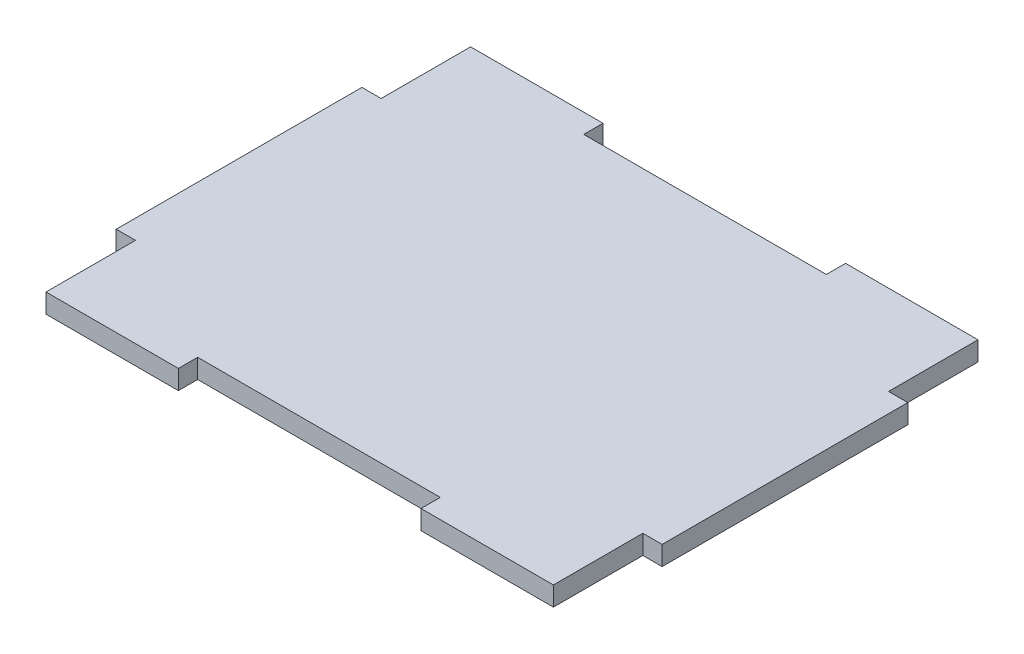
ISO-10303-21;
HEADER;
FILE_DESCRIPTION(('STEP AP214'),'2;1');
FILE_NAME('part.step','',(''),(''),'','','');
FILE_SCHEMA(('AUTOMOTIVE_DESIGN { 1 0 10303 214 1 1 1 1 }'));
ENDSEC;
DATA;
#1=APPLICATION_CONTEXT('core data for automotive mechanical design processes');
#2=APPLICATION_PROTOCOL_DEFINITION('international standard','automotive_design',2000,#1);
#3=PRODUCT_CONTEXT('',#1,'mechanical');
#4=PRODUCT('Part','Part','',(#3));
#5=PRODUCT_RELATED_PRODUCT_CATEGORY('part','',(#4));
#6=PRODUCT_DEFINITION_FORMATION('','',#4);
#7=PRODUCT_DEFINITION_CONTEXT('part definition',#1,'design');
#8=PRODUCT_DEFINITION('design','',#6,#7);
#9=PRODUCT_DEFINITION_SHAPE('','',#8);
#10=(LENGTH_UNIT() NAMED_UNIT(*) SI_UNIT(.MILLI.,.METRE.));
#11=(NAMED_UNIT(*) PLANE_ANGLE_UNIT() SI_UNIT($,.RADIAN.));
#12=(NAMED_UNIT(*) SI_UNIT($,.STERADIAN.) SOLID_ANGLE_UNIT());
#13=UNCERTAINTY_MEASURE_WITH_UNIT(LENGTH_MEASURE(1.E-05),#10,'distance_accuracy_value','');
#14=(GEOMETRIC_REPRESENTATION_CONTEXT(3) GLOBAL_UNCERTAINTY_ASSIGNED_CONTEXT((#13)) GLOBAL_UNIT_ASSIGNED_CONTEXT((#10,
#11,#12)) REPRESENTATION_CONTEXT('',''));
#15=CARTESIAN_POINT('',(0.,0.,0.));
#16=DIRECTION('',(0.,0.,1.));
#17=DIRECTION('',(1.,0.,0.));
#18=AXIS2_PLACEMENT_3D('',#15,#16,#17);
#19=CARTESIAN_POINT('',(-41.825,3.175,0.));
#20=DIRECTION('',(-1.,0.,0.));
#21=DIRECTION('',(0.,0.,1.));
#22=AXIS2_PLACEMENT_3D('',#19,#20,#21);
#23=PLANE('',#22);
#24=DIRECTION('',(0.,0.,-1.));
#25=VECTOR('',#24,1.);
#26=CARTESIAN_POINT('',(-41.825,0.,0.));
#27=LINE('',#26,#25);
#28=CARTESIAN_POINT('',(-41.825,0.,35.));
#29=VERTEX_POINT('',#28);
#30=CARTESIAN_POINT('',(-41.825,0.,20.25));
#31=VERTEX_POINT('',#30);
#32=EDGE_CURVE('E198',#29,#31,#27,.T.);
#33=ORIENTED_EDGE('',*,*,#32,.F.);
#34=DIRECTION('',(0.,-1.,0.));
#35=VECTOR('',#34,1.);
#36=CARTESIAN_POINT('',(-41.825,3.175,35.));
#37=LINE('',#36,#35);
#38=CARTESIAN_POINT('',(-41.825,3.175,35.));
#39=VERTEX_POINT('',#38);
#40=EDGE_CURVE('E11',#39,#29,#37,.T.);
#41=ORIENTED_EDGE('',*,*,#40,.F.);
#42=DIRECTION('',(0.,0.,-1.));
#43=VECTOR('',#42,1.);
#44=CARTESIAN_POINT('',(-41.825,3.175,0.));
#45=LINE('',#44,#43);
#46=CARTESIAN_POINT('',(-41.825,3.175,20.25));
#47=VERTEX_POINT('',#46);
#48=EDGE_CURVE('E249',#39,#47,#45,.T.);
#49=ORIENTED_EDGE('',*,*,#48,.T.);
#50=DIRECTION('',(0.,-1.,0.));
#51=VECTOR('',#50,1.);
#52=CARTESIAN_POINT('',(-41.825,3.175,20.25));
#53=LINE('',#52,#51);
#54=EDGE_CURVE('E118',#47,#31,#53,.T.);
#55=ORIENTED_EDGE('',*,*,#54,.T.);
#56=EDGE_LOOP('',(#33,#41,#49,#55));
#57=FACE_BOUND('',#56,.T.);
#58=ADVANCED_FACE('F32',(#57),#23,.T.);
#59=CARTESIAN_POINT('',(0.,3.175,35.));
#60=DIRECTION('',(0.,0.,-1.));
#61=DIRECTION('',(-1.,0.,0.));
#62=AXIS2_PLACEMENT_3D('',#59,#60,#61);
#63=PLANE('',#62);
#64=DIRECTION('',(1.,0.,0.));
#65=VECTOR('',#64,1.);
#66=CARTESIAN_POINT('',(0.,0.,35.));
#67=LINE('',#66,#65);
#68=CARTESIAN_POINT('',(-20.,0.,35.));
#69=VERTEX_POINT('',#68);
#70=EDGE_CURVE('E201',#29,#69,#67,.T.);
#71=ORIENTED_EDGE('',*,*,#70,.T.);
#72=DIRECTION('',(0.,-1.,0.));
#73=VECTOR('',#72,1.);
#74=CARTESIAN_POINT('',(-20.,3.175,35.));
#75=LINE('',#74,#73);
#76=CARTESIAN_POINT('',(-20.,3.175,35.));
#77=VERTEX_POINT('',#76);
#78=EDGE_CURVE('E40',#77,#69,#75,.T.);
#79=ORIENTED_EDGE('',*,*,#78,.F.);
#80=DIRECTION('',(1.,0.,0.));
#81=VECTOR('',#80,1.);
#82=CARTESIAN_POINT('',(0.,3.175,35.));
#83=LINE('',#82,#81);
#84=EDGE_CURVE('E310',#39,#77,#83,.T.);
#85=ORIENTED_EDGE('',*,*,#84,.F.);
#86=ORIENTED_EDGE('',*,*,#40,.T.);
#87=EDGE_LOOP('',(#71,#79,#85,#86));
#88=FACE_BOUND('',#87,.T.);
#89=ADVANCED_FACE('F345',(#88),#63,.F.);
#90=CARTESIAN_POINT('',(-20.,3.175,0.));
#91=DIRECTION('',(-1.,0.,0.));
#92=DIRECTION('',(0.,0.,1.));
#93=AXIS2_PLACEMENT_3D('',#90,#91,#92);
#94=PLANE('',#93);
#95=DIRECTION('',(0.,0.,-1.));
#96=VECTOR('',#95,1.);
#97=CARTESIAN_POINT('',(-20.,0.,0.));
#98=LINE('',#97,#96);
#99=CARTESIAN_POINT('',(-20.,0.,31.825));
#100=VERTEX_POINT('',#99);
#101=EDGE_CURVE('E203',#69,#100,#98,.T.);
#102=ORIENTED_EDGE('',*,*,#101,.T.);
#103=DIRECTION('',(0.,-1.,0.));
#104=VECTOR('',#103,1.);
#105=CARTESIAN_POINT('',(-20.,3.175,31.825));
#106=LINE('',#105,#104);
#107=CARTESIAN_POINT('',(-20.,3.175,31.825));
#108=VERTEX_POINT('',#107);
#109=EDGE_CURVE('E282',#108,#100,#106,.T.);
#110=ORIENTED_EDGE('',*,*,#109,.F.);
#111=DIRECTION('',(0.,0.,-1.));
#112=VECTOR('',#111,1.);
#113=CARTESIAN_POINT('',(-20.,3.175,0.));
#114=LINE('',#113,#112);
#115=EDGE_CURVE('E291',#77,#108,#114,.T.);
#116=ORIENTED_EDGE('',*,*,#115,.F.);
#117=ORIENTED_EDGE('',*,*,#78,.T.);
#118=EDGE_LOOP('',(#102,#110,#116,#117));
#119=FACE_BOUND('',#118,.T.);
#120=ADVANCED_FACE('F289',(#119),#94,.F.);
#121=CARTESIAN_POINT('',(0.,3.175,31.825));
#122=DIRECTION('',(0.,0.,-1.));
#123=DIRECTION('',(-1.,0.,0.));
#124=AXIS2_PLACEMENT_3D('',#121,#122,#123);
#125=PLANE('',#124);
#126=DIRECTION('',(1.,0.,0.));
#127=VECTOR('',#126,1.);
#128=CARTESIAN_POINT('',(0.,0.,31.825));
#129=LINE('',#128,#127);
#130=CARTESIAN_POINT('',(20.,0.,31.825));
#131=VERTEX_POINT('',#130);
#132=EDGE_CURVE('E205',#100,#131,#129,.T.);
#133=ORIENTED_EDGE('',*,*,#132,.T.);
#134=DIRECTION('',(0.,-1.,0.));
#135=VECTOR('',#134,1.);
#136=CARTESIAN_POINT('',(20.,3.175,31.825));
#137=LINE('',#136,#135);
#138=CARTESIAN_POINT('',(20.,3.175,31.825));
#139=VERTEX_POINT('',#138);
#140=EDGE_CURVE('E280',#139,#131,#137,.T.);
#141=ORIENTED_EDGE('',*,*,#140,.F.);
#142=DIRECTION('',(1.,0.,0.));
#143=VECTOR('',#142,1.);
#144=CARTESIAN_POINT('',(0.,3.175,31.825));
#145=LINE('',#144,#143);
#146=EDGE_CURVE('E304',#108,#139,#145,.T.);
#147=ORIENTED_EDGE('',*,*,#146,.F.);
#148=ORIENTED_EDGE('',*,*,#109,.T.);
#149=EDGE_LOOP('',(#133,#141,#147,#148));
#150=FACE_BOUND('',#149,.T.);
#151=ADVANCED_FACE('F301',(#150),#125,.F.);
#152=CARTESIAN_POINT('',(20.,3.175,0.));
#153=DIRECTION('',(-1.,0.,0.));
#154=DIRECTION('',(0.,0.,1.));
#155=AXIS2_PLACEMENT_3D('',#152,#153,#154);
#156=PLANE('',#155);
#157=DIRECTION('',(0.,0.,-1.));
#158=VECTOR('',#157,1.);
#159=CARTESIAN_POINT('',(20.,0.,0.));
#160=LINE('',#159,#158);
#161=CARTESIAN_POINT('',(20.,0.,35.));
#162=VERTEX_POINT('',#161);
#163=EDGE_CURVE('E208',#162,#131,#160,.T.);
#164=ORIENTED_EDGE('',*,*,#163,.F.);
#165=DIRECTION('',(0.,-1.,0.));
#166=VECTOR('',#165,1.);
#167=CARTESIAN_POINT('',(20.,3.175,35.));
#168=LINE('',#167,#166);
#169=CARTESIAN_POINT('',(20.,3.175,35.));
#170=VERTEX_POINT('',#169);
#171=EDGE_CURVE('E278',#170,#162,#168,.T.);
#172=ORIENTED_EDGE('',*,*,#171,.F.);
#173=DIRECTION('',(0.,0.,-1.));
#174=VECTOR('',#173,1.);
#175=CARTESIAN_POINT('',(20.,3.175,0.));
#176=LINE('',#175,#174);
#177=EDGE_CURVE('E306',#170,#139,#176,.T.);
#178=ORIENTED_EDGE('',*,*,#177,.T.);
#179=ORIENTED_EDGE('',*,*,#140,.T.);
#180=EDGE_LOOP('',(#164,#172,#178,#179));
#181=FACE_BOUND('',#180,.T.);
#182=ADVANCED_FACE('F355',(#181),#156,.T.);
#183=CARTESIAN_POINT('',(0.,3.175,35.));
#184=DIRECTION('',(0.,0.,-1.));
#185=DIRECTION('',(-1.,0.,0.));
#186=AXIS2_PLACEMENT_3D('',#183,#184,#185);
#187=PLANE('',#186);
#188=DIRECTION('',(1.,0.,0.));
#189=VECTOR('',#188,1.);
#190=CARTESIAN_POINT('',(0.,0.,35.));
#191=LINE('',#190,#189);
#192=CARTESIAN_POINT('',(41.825,0.,35.));
#193=VERTEX_POINT('',#192);
#194=EDGE_CURVE('E211',#162,#193,#191,.T.);
#195=ORIENTED_EDGE('',*,*,#194,.T.);
#196=DIRECTION('',(0.,-1.,0.));
#197=VECTOR('',#196,1.);
#198=CARTESIAN_POINT('',(41.825,3.175,35.));
#199=LINE('',#198,#197);
#200=CARTESIAN_POINT('',(41.825,3.175,35.));
#201=VERTEX_POINT('',#200);
#202=EDGE_CURVE('E275',#201,#193,#199,.T.);
#203=ORIENTED_EDGE('',*,*,#202,.F.);
#204=DIRECTION('',(1.,0.,0.));
#205=VECTOR('',#204,1.);
#206=CARTESIAN_POINT('',(0.,3.175,35.));
#207=LINE('',#206,#205);
#208=EDGE_CURVE('E308',#170,#201,#207,.T.);
#209=ORIENTED_EDGE('',*,*,#208,.F.);
#210=ORIENTED_EDGE('',*,*,#171,.T.);
#211=EDGE_LOOP('',(#195,#203,#209,#210));
#212=FACE_BOUND('',#211,.T.);
#213=ADVANCED_FACE('F358',(#212),#187,.F.);
#214=CARTESIAN_POINT('',(41.825,3.175,0.));
#215=DIRECTION('',(-1.,0.,0.));
#216=DIRECTION('',(0.,0.,1.));
#217=AXIS2_PLACEMENT_3D('',#214,#215,#216);
#218=PLANE('',#217);
#219=DIRECTION('',(0.,0.,-1.));
#220=VECTOR('',#219,1.);
#221=CARTESIAN_POINT('',(41.825,0.,0.));
#222=LINE('',#221,#220);
#223=CARTESIAN_POINT('',(41.825,0.,20.25));
#224=VERTEX_POINT('',#223);
#225=EDGE_CURVE('E213',#193,#224,#222,.T.);
#226=ORIENTED_EDGE('',*,*,#225,.T.);
#227=DIRECTION('',(0.,-1.,0.));
#228=VECTOR('',#227,1.);
#229=CARTESIAN_POINT('',(41.825,3.175,20.25));
#230=LINE('',#229,#228);
#231=CARTESIAN_POINT('',(41.825,3.175,20.25));
#232=VERTEX_POINT('',#231);
#233=EDGE_CURVE('E273',#232,#224,#230,.T.);
#234=ORIENTED_EDGE('',*,*,#233,.F.);
#235=DIRECTION('',(0.,0.,-1.));
#236=VECTOR('',#235,1.);
#237=CARTESIAN_POINT('',(41.825,3.175,0.));
#238=LINE('',#237,#236);
#239=EDGE_CURVE('E315',#201,#232,#238,.T.);
#240=ORIENTED_EDGE('',*,*,#239,.F.);
#241=ORIENTED_EDGE('',*,*,#202,.T.);
#242=EDGE_LOOP('',(#226,#234,#240,#241));
#243=FACE_BOUND('',#242,.T.);
#244=ADVANCED_FACE('F362',(#243),#218,.F.);
#245=CARTESIAN_POINT('',(0.,3.175,20.25));
#246=DIRECTION('',(0.,0.,1.));
#247=DIRECTION('',(1.,0.,0.));
#248=AXIS2_PLACEMENT_3D('',#245,#246,#247);
#249=PLANE('',#248);
#250=DIRECTION('',(-1.,0.,0.));
#251=VECTOR('',#250,1.);
#252=CARTESIAN_POINT('',(0.,0.,20.25));
#253=LINE('',#252,#251);
#254=CARTESIAN_POINT('',(45.,0.,20.25));
#255=VERTEX_POINT('',#254);
#256=EDGE_CURVE('E216',#255,#224,#253,.T.);
#257=ORIENTED_EDGE('',*,*,#256,.F.);
#258=DIRECTION('',(0.,-1.,0.));
#259=VECTOR('',#258,1.);
#260=CARTESIAN_POINT('',(45.,3.175,20.25));
#261=LINE('',#260,#259);
#262=CARTESIAN_POINT('',(45.,3.175,20.25));
#263=VERTEX_POINT('',#262);
#264=EDGE_CURVE('E271',#263,#255,#261,.T.);
#265=ORIENTED_EDGE('',*,*,#264,.F.);
#266=DIRECTION('',(-1.,0.,0.));
#267=VECTOR('',#266,1.);
#268=CARTESIAN_POINT('',(0.,3.175,20.25));
#269=LINE('',#268,#267);
#270=EDGE_CURVE('E317',#263,#232,#269,.T.);
#271=ORIENTED_EDGE('',*,*,#270,.T.);
#272=ORIENTED_EDGE('',*,*,#233,.T.);
#273=EDGE_LOOP('',(#257,#265,#271,#272));
#274=FACE_BOUND('',#273,.T.);
#275=ADVANCED_FACE('F366',(#274),#249,.T.);
#276=CARTESIAN_POINT('',(45.,3.175,0.));
#277=DIRECTION('',(-1.,0.,0.));
#278=DIRECTION('',(0.,0.,1.));
#279=AXIS2_PLACEMENT_3D('',#276,#277,#278);
#280=PLANE('',#279);
#281=DIRECTION('',(0.,0.,-1.));
#282=VECTOR('',#281,1.);
#283=CARTESIAN_POINT('',(45.,0.,0.));
#284=LINE('',#283,#282);
#285=CARTESIAN_POINT('',(45.,0.,-20.25));
#286=VERTEX_POINT('',#285);
#287=EDGE_CURVE('E219',#255,#286,#284,.T.);
#288=ORIENTED_EDGE('',*,*,#287,.T.);
#289=DIRECTION('',(0.,-1.,0.));
#290=VECTOR('',#289,1.);
#291=CARTESIAN_POINT('',(45.,3.175,-20.25));
#292=LINE('',#291,#290);
#293=CARTESIAN_POINT('',(45.,3.175,-20.25));
#294=VERTEX_POINT('',#293);
#295=EDGE_CURVE('E268',#294,#286,#292,.T.);
#296=ORIENTED_EDGE('',*,*,#295,.F.);
#297=DIRECTION('',(0.,0.,-1.));
#298=VECTOR('',#297,1.);
#299=CARTESIAN_POINT('',(45.,3.175,0.));
#300=LINE('',#299,#298);
#301=EDGE_CURVE('E320',#263,#294,#300,.T.);
#302=ORIENTED_EDGE('',*,*,#301,.F.);
#303=ORIENTED_EDGE('',*,*,#264,.T.);
#304=EDGE_LOOP('',(#288,#296,#302,#303));
#305=FACE_BOUND('',#304,.T.);
#306=ADVANCED_FACE('F370',(#305),#280,.F.);
#307=CARTESIAN_POINT('',(0.,3.175,-20.25));
#308=DIRECTION('',(0.,0.,1.));
#309=DIRECTION('',(1.,0.,0.));
#310=AXIS2_PLACEMENT_3D('',#307,#308,#309);
#311=PLANE('',#310);
#312=DIRECTION('',(-1.,0.,0.));
#313=VECTOR('',#312,1.);
#314=CARTESIAN_POINT('',(0.,0.,-20.25));
#315=LINE('',#314,#313);
#316=CARTESIAN_POINT('',(41.825,0.,-20.25));
#317=VERTEX_POINT('',#316);
#318=EDGE_CURVE('E221',#286,#317,#315,.T.);
#319=ORIENTED_EDGE('',*,*,#318,.T.);
#320=DIRECTION('',(0.,-1.,0.));
#321=VECTOR('',#320,1.);
#322=CARTESIAN_POINT('',(41.825,3.175,-20.25));
#323=LINE('',#322,#321);
#324=CARTESIAN_POINT('',(41.825,3.175,-20.25));
#325=VERTEX_POINT('',#324);
#326=EDGE_CURVE('E265',#325,#317,#323,.T.);
#327=ORIENTED_EDGE('',*,*,#326,.F.);
#328=DIRECTION('',(-1.,0.,0.));
#329=VECTOR('',#328,1.);
#330=CARTESIAN_POINT('',(0.,3.175,-20.25));
#331=LINE('',#330,#329);
#332=EDGE_CURVE('E322',#294,#325,#331,.T.);
#333=ORIENTED_EDGE('',*,*,#332,.F.);
#334=ORIENTED_EDGE('',*,*,#295,.T.);
#335=EDGE_LOOP('',(#319,#327,#333,#334));
#336=FACE_BOUND('',#335,.T.);
#337=ADVANCED_FACE('F374',(#336),#311,.F.);
#338=CARTESIAN_POINT('',(41.825,3.175,0.));
#339=DIRECTION('',(-1.,0.,0.));
#340=DIRECTION('',(0.,0.,1.));
#341=AXIS2_PLACEMENT_3D('',#338,#339,#340);
#342=PLANE('',#341);
#343=DIRECTION('',(0.,0.,-1.));
#344=VECTOR('',#343,1.);
#345=CARTESIAN_POINT('',(41.825,0.,0.));
#346=LINE('',#345,#344);
#347=CARTESIAN_POINT('',(41.825,0.,-35.));
#348=VERTEX_POINT('',#347);
#349=EDGE_CURVE('E223',#317,#348,#346,.T.);
#350=ORIENTED_EDGE('',*,*,#349,.T.);
#351=DIRECTION('',(0.,-1.,0.));
#352=VECTOR('',#351,1.);
#353=CARTESIAN_POINT('',(41.825,3.175,-35.));
#354=LINE('',#353,#352);
#355=CARTESIAN_POINT('',(41.825,3.175,-35.));
#356=VERTEX_POINT('',#355);
#357=EDGE_CURVE('E263',#356,#348,#354,.T.);
#358=ORIENTED_EDGE('',*,*,#357,.F.);
#359=DIRECTION('',(0.,0.,-1.));
#360=VECTOR('',#359,1.);
#361=CARTESIAN_POINT('',(41.825,3.175,0.));
#362=LINE('',#361,#360);
#363=EDGE_CURVE('E324',#325,#356,#362,.T.);
#364=ORIENTED_EDGE('',*,*,#363,.F.);
#365=ORIENTED_EDGE('',*,*,#326,.T.);
#366=EDGE_LOOP('',(#350,#358,#364,#365));
#367=FACE_BOUND('',#366,.T.);
#368=ADVANCED_FACE('F378',(#367),#342,.F.);
#369=CARTESIAN_POINT('',(0.,3.175,-35.));
#370=DIRECTION('',(0.,0.,-1.));
#371=DIRECTION('',(-1.,0.,0.));
#372=AXIS2_PLACEMENT_3D('',#369,#370,#371);
#373=PLANE('',#372);
#374=DIRECTION('',(1.,0.,0.));
#375=VECTOR('',#374,1.);
#376=CARTESIAN_POINT('',(0.,0.,-35.));
#377=LINE('',#376,#375);
#378=CARTESIAN_POINT('',(20.,0.,-35.));
#379=VERTEX_POINT('',#378);
#380=EDGE_CURVE('E226',#379,#348,#377,.T.);
#381=ORIENTED_EDGE('',*,*,#380,.F.);
#382=DIRECTION('',(0.,-1.,0.));
#383=VECTOR('',#382,1.);
#384=CARTESIAN_POINT('',(20.,3.175,-35.));
#385=LINE('',#384,#383);
#386=CARTESIAN_POINT('',(20.,3.175,-35.));
#387=VERTEX_POINT('',#386);
#388=EDGE_CURVE('E261',#387,#379,#385,.T.);
#389=ORIENTED_EDGE('',*,*,#388,.F.);
#390=DIRECTION('',(1.,0.,0.));
#391=VECTOR('',#390,1.);
#392=CARTESIAN_POINT('',(0.,3.175,-35.));
#393=LINE('',#392,#391);
#394=EDGE_CURVE('E326',#387,#356,#393,.T.);
#395=ORIENTED_EDGE('',*,*,#394,.T.);
#396=ORIENTED_EDGE('',*,*,#357,.T.);
#397=EDGE_LOOP('',(#381,#389,#395,#396));
#398=FACE_BOUND('',#397,.T.);
#399=ADVANCED_FACE('F382',(#398),#373,.T.);
#400=CARTESIAN_POINT('',(20.,3.175,0.));
#401=DIRECTION('',(1.,0.,0.));
#402=DIRECTION('',(0.,0.,-1.));
#403=AXIS2_PLACEMENT_3D('',#400,#401,#402);
#404=PLANE('',#403);
#405=DIRECTION('',(0.,0.,1.));
#406=VECTOR('',#405,1.);
#407=CARTESIAN_POINT('',(20.,0.,0.));
#408=LINE('',#407,#406);
#409=CARTESIAN_POINT('',(20.,0.,-31.825));
#410=VERTEX_POINT('',#409);
#411=EDGE_CURVE('E229',#379,#410,#408,.T.);
#412=ORIENTED_EDGE('',*,*,#411,.T.);
#413=DIRECTION('',(0.,-1.,0.));
#414=VECTOR('',#413,1.);
#415=CARTESIAN_POINT('',(20.,3.175,-31.825));
#416=LINE('',#415,#414);
#417=CARTESIAN_POINT('',(20.,3.175,-31.825));
#418=VERTEX_POINT('',#417);
#419=EDGE_CURVE('E259',#418,#410,#416,.T.);
#420=ORIENTED_EDGE('',*,*,#419,.F.);
#421=DIRECTION('',(0.,0.,1.));
#422=VECTOR('',#421,1.);
#423=CARTESIAN_POINT('',(20.,3.175,0.));
#424=LINE('',#423,#422);
#425=EDGE_CURVE('E329',#387,#418,#424,.T.);
#426=ORIENTED_EDGE('',*,*,#425,.F.);
#427=ORIENTED_EDGE('',*,*,#388,.T.);
#428=EDGE_LOOP('',(#412,#420,#426,#427));
#429=FACE_BOUND('',#428,.T.);
#430=ADVANCED_FACE('F386',(#429),#404,.F.);
#431=CARTESIAN_POINT('',(0.,3.175,-31.825));
#432=DIRECTION('',(0.,0.,-1.));
#433=DIRECTION('',(-1.,0.,0.));
#434=AXIS2_PLACEMENT_3D('',#431,#432,#433);
#435=PLANE('',#434);
#436=DIRECTION('',(1.,0.,0.));
#437=VECTOR('',#436,1.);
#438=CARTESIAN_POINT('',(0.,0.,-31.825));
#439=LINE('',#438,#437);
#440=CARTESIAN_POINT('',(-20.,0.,-31.825));
#441=VERTEX_POINT('',#440);
#442=EDGE_CURVE('E232',#441,#410,#439,.T.);
#443=ORIENTED_EDGE('',*,*,#442,.F.);
#444=DIRECTION('',(0.,-1.,0.));
#445=VECTOR('',#444,1.);
#446=CARTESIAN_POINT('',(-20.,3.175,-31.825));
#447=LINE('',#446,#445);
#448=CARTESIAN_POINT('',(-20.,3.175,-31.825));
#449=VERTEX_POINT('',#448);
#450=EDGE_CURVE('E257',#449,#441,#447,.T.);
#451=ORIENTED_EDGE('',*,*,#450,.F.);
#452=DIRECTION('',(1.,0.,0.));
#453=VECTOR('',#452,1.);
#454=CARTESIAN_POINT('',(0.,3.175,-31.825));
#455=LINE('',#454,#453);
#456=EDGE_CURVE('E331',#449,#418,#455,.T.);
#457=ORIENTED_EDGE('',*,*,#456,.T.);
#458=ORIENTED_EDGE('',*,*,#419,.T.);
#459=EDGE_LOOP('',(#443,#451,#457,#458));
#460=FACE_BOUND('',#459,.T.);
#461=ADVANCED_FACE('F390',(#460),#435,.T.);
#462=CARTESIAN_POINT('',(-20.,3.175,0.));
#463=DIRECTION('',(1.,0.,0.));
#464=DIRECTION('',(0.,0.,-1.));
#465=AXIS2_PLACEMENT_3D('',#462,#463,#464);
#466=PLANE('',#465);
#467=DIRECTION('',(0.,0.,1.));
#468=VECTOR('',#467,1.);
#469=CARTESIAN_POINT('',(-20.,0.,0.));
#470=LINE('',#469,#468);
#471=CARTESIAN_POINT('',(-20.,0.,-35.));
#472=VERTEX_POINT('',#471);
#473=EDGE_CURVE('E235',#472,#441,#470,.T.);
#474=ORIENTED_EDGE('',*,*,#473,.F.);
#475=DIRECTION('',(0.,-1.,0.));
#476=VECTOR('',#475,1.);
#477=CARTESIAN_POINT('',(-20.,3.175,-35.));
#478=LINE('',#477,#476);
#479=CARTESIAN_POINT('',(-20.,3.175,-35.));
#480=VERTEX_POINT('',#479);
#481=EDGE_CURVE('E255',#480,#472,#478,.T.);
#482=ORIENTED_EDGE('',*,*,#481,.F.);
#483=DIRECTION('',(0.,0.,1.));
#484=VECTOR('',#483,1.);
#485=CARTESIAN_POINT('',(-20.,3.175,0.));
#486=LINE('',#485,#484);
#487=EDGE_CURVE('E334',#480,#449,#486,.T.);
#488=ORIENTED_EDGE('',*,*,#487,.T.);
#489=ORIENTED_EDGE('',*,*,#450,.T.);
#490=EDGE_LOOP('',(#474,#482,#488,#489));
#491=FACE_BOUND('',#490,.T.);
#492=ADVANCED_FACE('F394',(#491),#466,.T.);
#493=CARTESIAN_POINT('',(0.,3.175,-35.));
#494=DIRECTION('',(0.,0.,-1.));
#495=DIRECTION('',(-1.,0.,0.));
#496=AXIS2_PLACEMENT_3D('',#493,#494,#495);
#497=PLANE('',#496);
#498=DIRECTION('',(1.,0.,0.));
#499=VECTOR('',#498,1.);
#500=CARTESIAN_POINT('',(0.,0.,-35.));
#501=LINE('',#500,#499);
#502=CARTESIAN_POINT('',(-41.825,0.,-35.));
#503=VERTEX_POINT('',#502);
#504=EDGE_CURVE('E238',#503,#472,#501,.T.);
#505=ORIENTED_EDGE('',*,*,#504,.F.);
#506=DIRECTION('',(0.,-1.,0.));
#507=VECTOR('',#506,1.);
#508=CARTESIAN_POINT('',(-41.825,3.175,-35.));
#509=LINE('',#508,#507);
#510=CARTESIAN_POINT('',(-41.825,3.175,-35.));
#511=VERTEX_POINT('',#510);
#512=EDGE_CURVE('E253',#511,#503,#509,.T.);
#513=ORIENTED_EDGE('',*,*,#512,.F.);
#514=DIRECTION('',(1.,0.,0.));
#515=VECTOR('',#514,1.);
#516=CARTESIAN_POINT('',(0.,3.175,-35.));
#517=LINE('',#516,#515);
#518=EDGE_CURVE('E337',#511,#480,#517,.T.);
#519=ORIENTED_EDGE('',*,*,#518,.T.);
#520=ORIENTED_EDGE('',*,*,#481,.T.);
#521=EDGE_LOOP('',(#505,#513,#519,#520));
#522=FACE_BOUND('',#521,.T.);
#523=ADVANCED_FACE('F398',(#522),#497,.T.);
#524=CARTESIAN_POINT('',(-41.825,3.175,0.));
#525=DIRECTION('',(-1.,0.,0.));
#526=DIRECTION('',(0.,0.,1.));
#527=AXIS2_PLACEMENT_3D('',#524,#525,#526);
#528=PLANE('',#527);
#529=DIRECTION('',(0.,0.,-1.));
#530=VECTOR('',#529,1.);
#531=CARTESIAN_POINT('',(-41.825,0.,0.));
#532=LINE('',#531,#530);
#533=CARTESIAN_POINT('',(-41.825,0.,-20.25));
#534=VERTEX_POINT('',#533);
#535=EDGE_CURVE('E241',#534,#503,#532,.T.);
#536=ORIENTED_EDGE('',*,*,#535,.F.);
#537=DIRECTION('',(0.,-1.,0.));
#538=VECTOR('',#537,1.);
#539=CARTESIAN_POINT('',(-41.825,3.175,-20.25));
#540=LINE('',#539,#538);
#541=CARTESIAN_POINT('',(-41.825,3.175,-20.25));
#542=VERTEX_POINT('',#541);
#543=EDGE_CURVE('E184',#542,#534,#540,.T.);
#544=ORIENTED_EDGE('',*,*,#543,.F.);
#545=DIRECTION('',(0.,0.,-1.));
#546=VECTOR('',#545,1.);
#547=CARTESIAN_POINT('',(-41.825,3.175,0.));
#548=LINE('',#547,#546);
#549=EDGE_CURVE('E191',#542,#511,#548,.T.);
#550=ORIENTED_EDGE('',*,*,#549,.T.);
#551=ORIENTED_EDGE('',*,*,#512,.T.);
#552=EDGE_LOOP('',(#536,#544,#550,#551));
#553=FACE_BOUND('',#552,.T.);
#554=ADVANCED_FACE('F341',(#553),#528,.T.);
#555=CARTESIAN_POINT('',(0.,3.175,-20.25));
#556=DIRECTION('',(0.,0.,-1.));
#557=DIRECTION('',(-1.,0.,0.));
#558=AXIS2_PLACEMENT_3D('',#555,#556,#557);
#559=PLANE('',#558);
#560=DIRECTION('',(1.,0.,0.));
#561=VECTOR('',#560,1.);
#562=CARTESIAN_POINT('',(0.,0.,-20.25));
#563=LINE('',#562,#561);
#564=CARTESIAN_POINT('',(-45.,0.,-20.25));
#565=VERTEX_POINT('',#564);
#566=EDGE_CURVE('E179',#565,#534,#563,.T.);
#567=ORIENTED_EDGE('',*,*,#566,.F.);
#568=DIRECTION('',(0.,-1.,0.));
#569=VECTOR('',#568,1.);
#570=CARTESIAN_POINT('',(-45.,3.175,-20.25));
#571=LINE('',#570,#569);
#572=CARTESIAN_POINT('',(-45.,3.175,-20.25));
#573=VERTEX_POINT('',#572);
#574=EDGE_CURVE('E174',#573,#565,#571,.T.);
#575=ORIENTED_EDGE('',*,*,#574,.F.);
#576=DIRECTION('',(1.,0.,0.));
#577=VECTOR('',#576,1.);
#578=CARTESIAN_POINT('',(0.,3.175,-20.25));
#579=LINE('',#578,#577);
#580=EDGE_CURVE('E177',#573,#542,#579,.T.);
#581=ORIENTED_EDGE('',*,*,#580,.T.);
#582=ORIENTED_EDGE('',*,*,#543,.T.);
#583=EDGE_LOOP('',(#567,#575,#581,#582));
#584=FACE_BOUND('',#583,.T.);
#585=ADVANCED_FACE('F176',(#584),#559,.T.);
#586=CARTESIAN_POINT('',(-45.,3.175,0.));
#587=DIRECTION('',(-1.,0.,0.));
#588=DIRECTION('',(0.,0.,1.));
#589=AXIS2_PLACEMENT_3D('',#586,#587,#588);
#590=PLANE('',#589);
#591=DIRECTION('',(0.,0.,-1.));
#592=VECTOR('',#591,1.);
#593=CARTESIAN_POINT('',(-45.,0.,0.));
#594=LINE('',#593,#592);
#595=CARTESIAN_POINT('',(-45.,0.,20.25));
#596=VERTEX_POINT('',#595);
#597=EDGE_CURVE('E245',#596,#565,#594,.T.);
#598=ORIENTED_EDGE('',*,*,#597,.F.);
#599=DIRECTION('',(0.,-1.,0.));
#600=VECTOR('',#599,1.);
#601=CARTESIAN_POINT('',(-45.,3.175,20.25));
#602=LINE('',#601,#600);
#603=CARTESIAN_POINT('',(-45.,3.175,20.25));
#604=VERTEX_POINT('',#603);
#605=EDGE_CURVE('E111',#604,#596,#602,.T.);
#606=ORIENTED_EDGE('',*,*,#605,.F.);
#607=DIRECTION('',(0.,0.,-1.));
#608=VECTOR('',#607,1.);
#609=CARTESIAN_POINT('',(-45.,3.175,0.));
#610=LINE('',#609,#608);
#611=EDGE_CURVE('E188',#604,#573,#610,.T.);
#612=ORIENTED_EDGE('',*,*,#611,.T.);
#613=ORIENTED_EDGE('',*,*,#574,.T.);
#614=EDGE_LOOP('',(#598,#606,#612,#613));
#615=FACE_BOUND('',#614,.T.);
#616=ADVANCED_FACE('F193',(#615),#590,.T.);
#617=CARTESIAN_POINT('',(0.,3.175,20.25));
#618=DIRECTION('',(0.,0.,-1.));
#619=DIRECTION('',(-1.,0.,0.));
#620=AXIS2_PLACEMENT_3D('',#617,#618,#619);
#621=PLANE('',#620);
#622=DIRECTION('',(1.,0.,0.));
#623=VECTOR('',#622,1.);
#624=CARTESIAN_POINT('',(0.,0.,20.25));
#625=LINE('',#624,#623);
#626=EDGE_CURVE('E247',#596,#31,#625,.T.);
#627=ORIENTED_EDGE('',*,*,#626,.T.);
#628=ORIENTED_EDGE('',*,*,#54,.F.);
#629=DIRECTION('',(1.,0.,0.));
#630=VECTOR('',#629,1.);
#631=CARTESIAN_POINT('',(0.,3.175,20.25));
#632=LINE('',#631,#630);
#633=EDGE_CURVE('E48',#604,#47,#632,.T.);
#634=ORIENTED_EDGE('',*,*,#633,.F.);
#635=ORIENTED_EDGE('',*,*,#605,.T.);
#636=EDGE_LOOP('',(#627,#628,#634,#635));
#637=FACE_BOUND('',#636,.T.);
#638=ADVANCED_FACE('F343',(#637),#621,.F.);
#639=CARTESIAN_POINT('',(0.,3.175,0.));
#640=DIRECTION('',(0.,1.,0.));
#641=DIRECTION('',(0.,0.,1.));
#642=AXIS2_PLACEMENT_3D('',#639,#640,#641);
#643=PLANE('',#642);
#644=ORIENTED_EDGE('',*,*,#48,.F.);
#645=ORIENTED_EDGE('',*,*,#84,.T.);
#646=ORIENTED_EDGE('',*,*,#115,.T.);
#647=ORIENTED_EDGE('',*,*,#146,.T.);
#648=ORIENTED_EDGE('',*,*,#177,.F.);
#649=ORIENTED_EDGE('',*,*,#208,.T.);
#650=ORIENTED_EDGE('',*,*,#239,.T.);
#651=ORIENTED_EDGE('',*,*,#270,.F.);
#652=ORIENTED_EDGE('',*,*,#301,.T.);
#653=ORIENTED_EDGE('',*,*,#332,.T.);
#654=ORIENTED_EDGE('',*,*,#363,.T.);
#655=ORIENTED_EDGE('',*,*,#394,.F.);
#656=ORIENTED_EDGE('',*,*,#425,.T.);
#657=ORIENTED_EDGE('',*,*,#456,.F.);
#658=ORIENTED_EDGE('',*,*,#487,.F.);
#659=ORIENTED_EDGE('',*,*,#518,.F.);
#660=ORIENTED_EDGE('',*,*,#549,.F.);
#661=ORIENTED_EDGE('',*,*,#580,.F.);
#662=ORIENTED_EDGE('',*,*,#611,.F.);
#663=ORIENTED_EDGE('',*,*,#633,.T.);
#664=EDGE_LOOP('',(#644,#645,#646,#647,#648,#649,#650,#651,#652,#653,#654,#655,#656,#657,#658,
#659,#660,#661,#662,#663));
#665=FACE_BOUND('',#664,.T.);
#666=ADVANCED_FACE('F187',(#665),#643,.T.);
#667=CARTESIAN_POINT('',(0.,0.,0.));
#668=DIRECTION('',(0.,1.,0.));
#669=DIRECTION('',(0.,0.,1.));
#670=AXIS2_PLACEMENT_3D('',#667,#668,#669);
#671=PLANE('',#670);
#672=ORIENTED_EDGE('',*,*,#32,.T.);
#673=ORIENTED_EDGE('',*,*,#626,.F.);
#674=ORIENTED_EDGE('',*,*,#597,.T.);
#675=ORIENTED_EDGE('',*,*,#566,.T.);
#676=ORIENTED_EDGE('',*,*,#535,.T.);
#677=ORIENTED_EDGE('',*,*,#504,.T.);
#678=ORIENTED_EDGE('',*,*,#473,.T.);
#679=ORIENTED_EDGE('',*,*,#442,.T.);
#680=ORIENTED_EDGE('',*,*,#411,.F.);
#681=ORIENTED_EDGE('',*,*,#380,.T.);
#682=ORIENTED_EDGE('',*,*,#349,.F.);
#683=ORIENTED_EDGE('',*,*,#318,.F.);
#684=ORIENTED_EDGE('',*,*,#287,.F.);
#685=ORIENTED_EDGE('',*,*,#256,.T.);
#686=ORIENTED_EDGE('',*,*,#225,.F.);
#687=ORIENTED_EDGE('',*,*,#194,.F.);
#688=ORIENTED_EDGE('',*,*,#163,.T.);
#689=ORIENTED_EDGE('',*,*,#132,.F.);
#690=ORIENTED_EDGE('',*,*,#101,.F.);
#691=ORIENTED_EDGE('',*,*,#70,.F.);
#692=EDGE_LOOP('',(#672,#673,#674,#675,#676,#677,#678,#679,#680,#681,#682,#683,#684,#685,#686,
#687,#688,#689,#690,#691));
#693=FACE_BOUND('',#692,.T.);
#694=ADVANCED_FACE('F296',(#693),#671,.F.);
#695=CLOSED_SHELL('',(#58,#89,#120,#151,#182,#213,#244,#275,#306,#337,#368,#399,#430,#461,#492,
#523,#554,#585,#616,#638,#666,#694));
#696=MANIFOLD_SOLID_BREP('B2',#695);
#697=ADVANCED_BREP_SHAPE_REPRESENTATION('',(#18,#696),#14);
#698=SHAPE_DEFINITION_REPRESENTATION(#9,#697);
ENDSEC;
END-ISO-10303-21;
